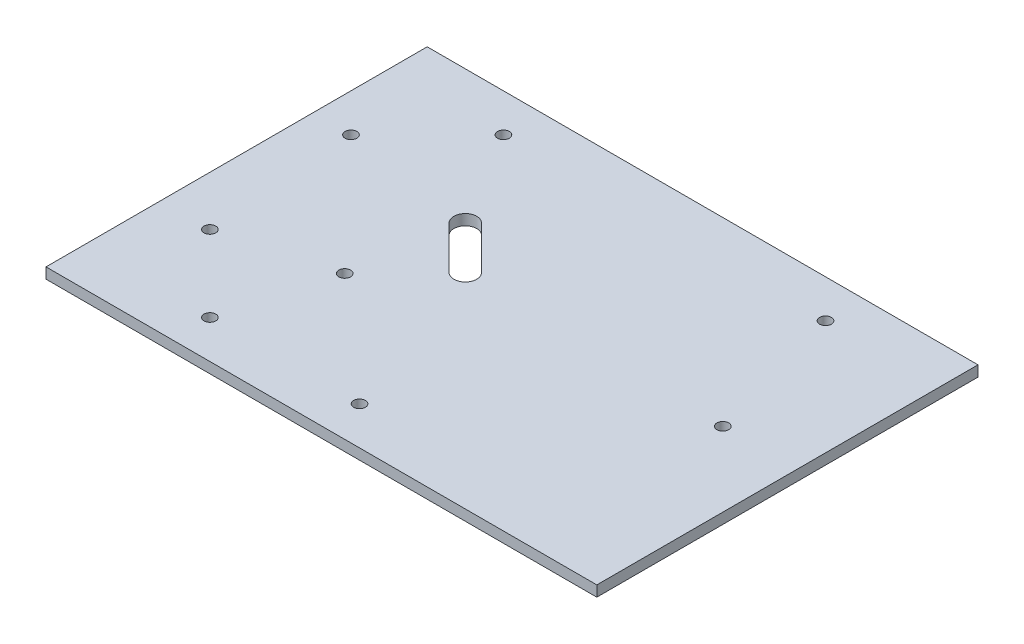
ISO-10303-21;
HEADER;
FILE_DESCRIPTION(('STEP AP214'),'2;1');
FILE_NAME('part.step','',(''),(''),'','','');
FILE_SCHEMA(('AUTOMOTIVE_DESIGN { 1 0 10303 214 1 1 1 1 }'));
ENDSEC;
DATA;
#1=APPLICATION_CONTEXT('core data for automotive mechanical design processes');
#2=APPLICATION_PROTOCOL_DEFINITION('international standard','automotive_design',2000,#1);
#3=PRODUCT_CONTEXT('',#1,'mechanical');
#4=PRODUCT('Part','Part','',(#3));
#5=PRODUCT_RELATED_PRODUCT_CATEGORY('part','',(#4));
#6=PRODUCT_DEFINITION_FORMATION('','',#4);
#7=PRODUCT_DEFINITION_CONTEXT('part definition',#1,'design');
#8=PRODUCT_DEFINITION('design','',#6,#7);
#9=PRODUCT_DEFINITION_SHAPE('','',#8);
#10=(LENGTH_UNIT() NAMED_UNIT(*) SI_UNIT(.MILLI.,.METRE.));
#11=(NAMED_UNIT(*) PLANE_ANGLE_UNIT() SI_UNIT($,.RADIAN.));
#12=(NAMED_UNIT(*) SI_UNIT($,.STERADIAN.) SOLID_ANGLE_UNIT());
#13=UNCERTAINTY_MEASURE_WITH_UNIT(LENGTH_MEASURE(1.E-05),#10,'distance_accuracy_value','');
#14=(GEOMETRIC_REPRESENTATION_CONTEXT(3) GLOBAL_UNCERTAINTY_ASSIGNED_CONTEXT((#13)) GLOBAL_UNIT_ASSIGNED_CONTEXT((#10,
#11,#12)) REPRESENTATION_CONTEXT('',''));
#15=CARTESIAN_POINT('',(0.,0.,0.));
#16=DIRECTION('',(0.,0.,1.));
#17=DIRECTION('',(1.,0.,0.));
#18=AXIS2_PLACEMENT_3D('',#15,#16,#17);
#19=CARTESIAN_POINT('',(0.,2.8,0.));
#20=DIRECTION('',(0.,-1.,0.));
#21=DIRECTION('',(0.,0.,-1.));
#22=AXIS2_PLACEMENT_3D('',#19,#20,#21);
#23=PLANE('',#22);
#24=CARTESIAN_POINT('',(52.75,2.8,-2.56000000000001));
#25=DIRECTION('',(0.,1.,0.));
#26=DIRECTION('',(0.,0.,1.));
#27=AXIS2_PLACEMENT_3D('',#24,#25,#26);
#28=CIRCLE('',#27,1.55);
#29=CARTESIAN_POINT('',(52.75,2.8,-1.01000000000001));
#30=VERTEX_POINT('',#29);
#31=EDGE_CURVE('E275',#30,#30,#28,.T.);
#32=ORIENTED_EDGE('',*,*,#31,.F.);
#33=EDGE_LOOP('',(#32));
#34=FACE_BOUND('',#33,.T.);
#35=CARTESIAN_POINT('',(-62.25,2.8,-20.));
#36=DIRECTION('',(0.,1.,0.));
#37=DIRECTION('',(0.,0.,1.));
#38=AXIS2_PLACEMENT_3D('',#35,#36,#37);
#39=CIRCLE('',#38,1.54999999999999);
#40=CARTESIAN_POINT('',(-62.25,2.8,-18.45));
#41=VERTEX_POINT('',#40);
#42=EDGE_CURVE('E283',#41,#41,#39,.T.);
#43=ORIENTED_EDGE('',*,*,#42,.F.);
#44=EDGE_LOOP('',(#43));
#45=FACE_BOUND('',#44,.T.);
#46=CARTESIAN_POINT('',(-42.25,2.8,-40.));
#47=DIRECTION('',(0.,1.,0.));
#48=DIRECTION('',(0.,0.,1.));
#49=AXIS2_PLACEMENT_3D('',#46,#47,#48);
#50=CIRCLE('',#49,1.55);
#51=CARTESIAN_POINT('',(-42.25,2.8,-38.45));
#52=VERTEX_POINT('',#51);
#53=EDGE_CURVE('E289',#52,#52,#50,.T.);
#54=ORIENTED_EDGE('',*,*,#53,.F.);
#55=EDGE_LOOP('',(#54));
#56=FACE_BOUND('',#55,.T.);
#57=CARTESIAN_POINT('',(42.25,2.8,-40.));
#58=DIRECTION('',(0.,1.,0.));
#59=DIRECTION('',(0.,0.,1.));
#60=AXIS2_PLACEMENT_3D('',#57,#58,#59);
#61=CIRCLE('',#60,1.55);
#62=CARTESIAN_POINT('',(42.25,2.8,-38.45));
#63=VERTEX_POINT('',#62);
#64=EDGE_CURVE('E295',#63,#63,#61,.T.);
#65=ORIENTED_EDGE('',*,*,#64,.F.);
#66=EDGE_LOOP('',(#65));
#67=FACE_BOUND('',#66,.T.);
#68=CARTESIAN_POINT('',(0.,2.8,40.));
#69=DIRECTION('',(0.,1.,0.));
#70=DIRECTION('',(0.,0.,1.));
#71=AXIS2_PLACEMENT_3D('',#68,#69,#70);
#72=CIRCLE('',#71,1.55);
#73=CARTESIAN_POINT('',(0.,2.8,41.55));
#74=VERTEX_POINT('',#73);
#75=EDGE_CURVE('E279',#74,#74,#72,.T.);
#76=ORIENTED_EDGE('',*,*,#75,.F.);
#77=EDGE_LOOP('',(#76));
#78=FACE_BOUND('',#77,.T.);
#79=DIRECTION('',(0.707106781186551,0.,0.707106781186544));
#80=VECTOR('',#79,1.);
#81=CARTESIAN_POINT('',(-29.3713203435596,2.8,-12.8786796564403));
#82=LINE('',#81,#80);
#83=CARTESIAN_POINT('',(-29.3713203435596,2.8,-12.8786796564403));
#84=VERTEX_POINT('',#83);
#85=CARTESIAN_POINT('',(-18.0576118445746,2.8,-1.56497115745581));
#86=VERTEX_POINT('',#85);
#87=EDGE_CURVE('E116',#84,#86,#82,.T.);
#88=ORIENTED_EDGE('',*,*,#87,.F.);
#89=CARTESIAN_POINT('',(-27.25,2.8,-15.));
#90=DIRECTION('',(0.,1.,0.));
#91=DIRECTION('',(0.,0.,1.));
#92=AXIS2_PLACEMENT_3D('',#89,#90,#91);
#93=CIRCLE('',#92,3.);
#94=CARTESIAN_POINT('',(-25.1286796564404,2.8,-17.1213203435596));
#95=VERTEX_POINT('',#94);
#96=EDGE_CURVE('E47',#95,#84,#93,.T.);
#97=ORIENTED_EDGE('',*,*,#96,.F.);
#98=DIRECTION('',(-0.707106781186551,0.,-0.707106781186544));
#99=VECTOR('',#98,1.);
#100=CARTESIAN_POINT('',(-25.1286796564404,2.8,-17.1213203435596));
#101=LINE('',#100,#99);
#102=CARTESIAN_POINT('',(-13.8149711574555,2.8,-5.80761184457495));
#103=VERTEX_POINT('',#102);
#104=EDGE_CURVE('E109',#103,#95,#101,.T.);
#105=ORIENTED_EDGE('',*,*,#104,.F.);
#106=CARTESIAN_POINT('',(-15.936291501015,2.8,-3.68629150101547));
#107=DIRECTION('',(0.,1.,0.));
#108=DIRECTION('',(0.,0.,1.));
#109=AXIS2_PLACEMENT_3D('',#106,#107,#108);
#110=CIRCLE('',#109,3.);
#111=EDGE_CURVE('E123',#86,#103,#110,.T.);
#112=ORIENTED_EDGE('',*,*,#111,.F.);
#113=EDGE_LOOP('',(#88,#97,#105,#112));
#114=FACE_BOUND('',#113,.T.);
#115=DIRECTION('',(0.,0.,-1.));
#116=VECTOR('',#115,1.);
#117=CARTESIAN_POINT('',(72.25,2.8,50.));
#118=LINE('',#117,#116);
#119=CARTESIAN_POINT('',(72.25,2.8,50.));
#120=VERTEX_POINT('',#119);
#121=CARTESIAN_POINT('',(72.25,2.8,-50.));
#122=VERTEX_POINT('',#121);
#123=EDGE_CURVE('E150',#120,#122,#118,.T.);
#124=ORIENTED_EDGE('',*,*,#123,.T.);
#125=DIRECTION('',(-1.,0.,0.));
#126=VECTOR('',#125,1.);
#127=CARTESIAN_POINT('',(-72.25,2.8,-50.));
#128=LINE('',#127,#126);
#129=CARTESIAN_POINT('',(-72.25,2.8,-50.));
#130=VERTEX_POINT('',#129);
#131=EDGE_CURVE('E153',#122,#130,#128,.T.);
#132=ORIENTED_EDGE('',*,*,#131,.T.);
#133=DIRECTION('',(0.,0.,1.));
#134=VECTOR('',#133,1.);
#135=CARTESIAN_POINT('',(-72.25,2.8,50.));
#136=LINE('',#135,#134);
#137=CARTESIAN_POINT('',(-72.25,2.8,50.));
#138=VERTEX_POINT('',#137);
#139=EDGE_CURVE('E156',#130,#138,#136,.T.);
#140=ORIENTED_EDGE('',*,*,#139,.T.);
#141=DIRECTION('',(1.,0.,0.));
#142=VECTOR('',#141,1.);
#143=CARTESIAN_POINT('',(-72.25,2.8,50.));
#144=LINE('',#143,#142);
#145=EDGE_CURVE('E158',#138,#120,#144,.T.);
#146=ORIENTED_EDGE('',*,*,#145,.T.);
#147=EDGE_LOOP('',(#124,#132,#140,#146));
#148=FACE_BOUND('',#147,.T.);
#149=CARTESIAN_POINT('',(-59.25,2.8,20.));
#150=DIRECTION('',(0.,1.,0.));
#151=DIRECTION('',(0.,0.,1.));
#152=AXIS2_PLACEMENT_3D('',#149,#150,#151);
#153=CIRCLE('',#152,1.55);
#154=CARTESIAN_POINT('',(-59.25,2.8,21.55));
#155=VERTEX_POINT('',#154);
#156=EDGE_CURVE('E144',#155,#155,#153,.T.);
#157=ORIENTED_EDGE('',*,*,#156,.F.);
#158=EDGE_LOOP('',(#157));
#159=FACE_BOUND('',#158,.T.);
#160=CARTESIAN_POINT('',(-39.25,2.8,40.));
#161=DIRECTION('',(0.,1.,0.));
#162=DIRECTION('',(0.,0.,1.));
#163=AXIS2_PLACEMENT_3D('',#160,#161,#162);
#164=CIRCLE('',#163,1.55);
#165=CARTESIAN_POINT('',(-39.25,2.8,41.55));
#166=VERTEX_POINT('',#165);
#167=EDGE_CURVE('E138',#166,#166,#164,.T.);
#168=ORIENTED_EDGE('',*,*,#167,.F.);
#169=EDGE_LOOP('',(#168));
#170=FACE_BOUND('',#169,.T.);
#171=CARTESIAN_POINT('',(-31.5723304703363,2.8,12.3223304703363));
#172=DIRECTION('',(0.,1.,0.));
#173=DIRECTION('',(0.,0.,1.));
#174=AXIS2_PLACEMENT_3D('',#171,#172,#173);
#175=CIRCLE('',#174,1.55);
#176=CARTESIAN_POINT('',(-31.5723304703363,2.8,13.8723304703363));
#177=VERTEX_POINT('',#176);
#178=EDGE_CURVE('E132',#177,#177,#175,.T.);
#179=ORIENTED_EDGE('',*,*,#178,.F.);
#180=EDGE_LOOP('',(#179));
#181=FACE_BOUND('',#180,.T.);
#182=ADVANCED_FACE('F32',(#34,#45,#56,#67,#78,#114,#148,#159,#170,#181),#23,.F.);
#183=CARTESIAN_POINT('',(0.,0.,0.));
#184=DIRECTION('',(0.,-1.,0.));
#185=DIRECTION('',(0.,0.,-1.));
#186=AXIS2_PLACEMENT_3D('',#183,#184,#185);
#187=PLANE('',#186);
#188=CARTESIAN_POINT('',(52.75,0.,-2.56000000000001));
#189=DIRECTION('',(0.,-1.,0.));
#190=DIRECTION('',(0.,0.,-1.));
#191=AXIS2_PLACEMENT_3D('',#188,#189,#190);
#192=CIRCLE('',#191,1.55);
#193=CARTESIAN_POINT('',(52.75,0.,-4.11000000000001));
#194=VERTEX_POINT('',#193);
#195=EDGE_CURVE('E273',#194,#194,#192,.F.);
#196=ORIENTED_EDGE('',*,*,#195,.T.);
#197=EDGE_LOOP('',(#196));
#198=FACE_BOUND('',#197,.T.);
#199=CARTESIAN_POINT('',(-62.25,0.,-20.));
#200=DIRECTION('',(0.,-1.,0.));
#201=DIRECTION('',(0.,0.,-1.));
#202=AXIS2_PLACEMENT_3D('',#199,#200,#201);
#203=CIRCLE('',#202,1.54999999999999);
#204=CARTESIAN_POINT('',(-62.25,0.,-21.55));
#205=VERTEX_POINT('',#204);
#206=EDGE_CURVE('E286',#205,#205,#203,.F.);
#207=ORIENTED_EDGE('',*,*,#206,.T.);
#208=EDGE_LOOP('',(#207));
#209=FACE_BOUND('',#208,.T.);
#210=CARTESIAN_POINT('',(-42.25,0.,-40.));
#211=DIRECTION('',(0.,-1.,0.));
#212=DIRECTION('',(0.,0.,-1.));
#213=AXIS2_PLACEMENT_3D('',#210,#211,#212);
#214=CIRCLE('',#213,1.55);
#215=CARTESIAN_POINT('',(-42.25,0.,-41.55));
#216=VERTEX_POINT('',#215);
#217=EDGE_CURVE('E292',#216,#216,#214,.F.);
#218=ORIENTED_EDGE('',*,*,#217,.T.);
#219=EDGE_LOOP('',(#218));
#220=FACE_BOUND('',#219,.T.);
#221=CARTESIAN_POINT('',(42.25,0.,-40.));
#222=DIRECTION('',(0.,-1.,0.));
#223=DIRECTION('',(0.,0.,-1.));
#224=AXIS2_PLACEMENT_3D('',#221,#222,#223);
#225=CIRCLE('',#224,1.55);
#226=CARTESIAN_POINT('',(42.25,0.,-41.55));
#227=VERTEX_POINT('',#226);
#228=EDGE_CURVE('E298',#227,#227,#225,.F.);
#229=ORIENTED_EDGE('',*,*,#228,.T.);
#230=EDGE_LOOP('',(#229));
#231=FACE_BOUND('',#230,.T.);
#232=CARTESIAN_POINT('',(0.,0.,40.));
#233=DIRECTION('',(0.,-1.,0.));
#234=DIRECTION('',(0.,0.,-1.));
#235=AXIS2_PLACEMENT_3D('',#232,#233,#234);
#236=CIRCLE('',#235,1.55);
#237=CARTESIAN_POINT('',(0.,0.,38.45));
#238=VERTEX_POINT('',#237);
#239=EDGE_CURVE('E276',#238,#238,#236,.F.);
#240=ORIENTED_EDGE('',*,*,#239,.T.);
#241=EDGE_LOOP('',(#240));
#242=FACE_BOUND('',#241,.T.);
#243=CARTESIAN_POINT('',(-27.25,0.,-15.));
#244=DIRECTION('',(0.,-1.,0.));
#245=DIRECTION('',(0.,0.,-1.));
#246=AXIS2_PLACEMENT_3D('',#243,#244,#245);
#247=CIRCLE('',#246,3.);
#248=CARTESIAN_POINT('',(-25.1286796564404,0.,-17.1213203435596));
#249=VERTEX_POINT('',#248);
#250=CARTESIAN_POINT('',(-29.3713203435596,0.,-12.8786796564403));
#251=VERTEX_POINT('',#250);
#252=EDGE_CURVE('E107',#249,#251,#247,.F.);
#253=ORIENTED_EDGE('',*,*,#252,.T.);
#254=DIRECTION('',(0.707106781186551,0.,0.707106781186544));
#255=VECTOR('',#254,1.);
#256=CARTESIAN_POINT('',(-29.3713203435596,0.,-12.8786796564403));
#257=LINE('',#256,#255);
#258=CARTESIAN_POINT('',(-18.057611844575,0.,-1.56497115745581));
#259=VERTEX_POINT('',#258);
#260=EDGE_CURVE('E96',#251,#259,#257,.T.);
#261=ORIENTED_EDGE('',*,*,#260,.T.);
#262=CARTESIAN_POINT('',(-15.936291501015,0.,-3.68629150101547));
#263=DIRECTION('',(0.,-1.,0.));
#264=DIRECTION('',(0.,0.,-1.));
#265=AXIS2_PLACEMENT_3D('',#262,#263,#264);
#266=CIRCLE('',#265,3.);
#267=CARTESIAN_POINT('',(-13.8149711574554,0.,-5.80761184457512));
#268=VERTEX_POINT('',#267);
#269=EDGE_CURVE('E118',#259,#268,#266,.F.);
#270=ORIENTED_EDGE('',*,*,#269,.T.);
#271=DIRECTION('',(-0.707106781186551,0.,-0.707106781186544));
#272=VECTOR('',#271,1.);
#273=CARTESIAN_POINT('',(-25.1286796564404,0.,-17.1213203435596));
#274=LINE('',#273,#272);
#275=EDGE_CURVE('E114',#268,#249,#274,.T.);
#276=ORIENTED_EDGE('',*,*,#275,.T.);
#277=EDGE_LOOP('',(#253,#261,#270,#276));
#278=FACE_BOUND('',#277,.T.);
#279=CARTESIAN_POINT('',(-39.25,0.,40.));
#280=DIRECTION('',(0.,1.,0.));
#281=DIRECTION('',(0.,0.,1.));
#282=AXIS2_PLACEMENT_3D('',#279,#280,#281);
#283=CIRCLE('',#282,1.55);
#284=CARTESIAN_POINT('',(-39.25,0.,41.55));
#285=VERTEX_POINT('',#284);
#286=EDGE_CURVE('E135',#285,#285,#283,.T.);
#287=ORIENTED_EDGE('',*,*,#286,.T.);
#288=EDGE_LOOP('',(#287));
#289=FACE_BOUND('',#288,.T.);
#290=DIRECTION('',(0.,0.,-1.));
#291=VECTOR('',#290,1.);
#292=CARTESIAN_POINT('',(72.25,0.,50.));
#293=LINE('',#292,#291);
#294=CARTESIAN_POINT('',(72.25,0.,50.));
#295=VERTEX_POINT('',#294);
#296=CARTESIAN_POINT('',(72.25,0.,-50.));
#297=VERTEX_POINT('',#296);
#298=EDGE_CURVE('E147',#295,#297,#293,.T.);
#299=ORIENTED_EDGE('',*,*,#298,.F.);
#300=DIRECTION('',(1.,0.,0.));
#301=VECTOR('',#300,1.);
#302=CARTESIAN_POINT('',(-72.25,0.,50.));
#303=LINE('',#302,#301);
#304=CARTESIAN_POINT('',(-72.25,0.,50.));
#305=VERTEX_POINT('',#304);
#306=EDGE_CURVE('E154',#305,#295,#303,.T.);
#307=ORIENTED_EDGE('',*,*,#306,.F.);
#308=DIRECTION('',(0.,0.,1.));
#309=VECTOR('',#308,1.);
#310=CARTESIAN_POINT('',(-72.25,0.,50.));
#311=LINE('',#310,#309);
#312=CARTESIAN_POINT('',(-72.25,0.,-50.));
#313=VERTEX_POINT('',#312);
#314=EDGE_CURVE('E165',#313,#305,#311,.T.);
#315=ORIENTED_EDGE('',*,*,#314,.F.);
#316=DIRECTION('',(-1.,0.,0.));
#317=VECTOR('',#316,1.);
#318=CARTESIAN_POINT('',(-72.25,0.,-50.));
#319=LINE('',#318,#317);
#320=EDGE_CURVE('E163',#297,#313,#319,.T.);
#321=ORIENTED_EDGE('',*,*,#320,.F.);
#322=EDGE_LOOP('',(#299,#307,#315,#321));
#323=FACE_BOUND('',#322,.T.);
#324=CARTESIAN_POINT('',(-59.25,0.,20.));
#325=DIRECTION('',(0.,1.,0.));
#326=DIRECTION('',(0.,0.,1.));
#327=AXIS2_PLACEMENT_3D('',#324,#325,#326);
#328=CIRCLE('',#327,1.55);
#329=CARTESIAN_POINT('',(-59.25,0.,21.55));
#330=VERTEX_POINT('',#329);
#331=EDGE_CURVE('E141',#330,#330,#328,.T.);
#332=ORIENTED_EDGE('',*,*,#331,.T.);
#333=EDGE_LOOP('',(#332));
#334=FACE_BOUND('',#333,.T.);
#335=CARTESIAN_POINT('',(-31.5723304703363,0.,12.3223304703363));
#336=DIRECTION('',(0.,1.,0.));
#337=DIRECTION('',(0.,0.,1.));
#338=AXIS2_PLACEMENT_3D('',#335,#336,#337);
#339=CIRCLE('',#338,1.55);
#340=CARTESIAN_POINT('',(-31.5723304703363,0.,13.8723304703363));
#341=VERTEX_POINT('',#340);
#342=EDGE_CURVE('E103',#341,#341,#339,.T.);
#343=ORIENTED_EDGE('',*,*,#342,.T.);
#344=EDGE_LOOP('',(#343));
#345=FACE_BOUND('',#344,.T.);
#346=ADVANCED_FACE('F112',(#198,#209,#220,#231,#242,#278,#289,#323,#334,#345),#187,.T.);
#347=CARTESIAN_POINT('',(72.25,2.8,50.));
#348=DIRECTION('',(-1.,0.,0.));
#349=DIRECTION('',(0.,0.,1.));
#350=AXIS2_PLACEMENT_3D('',#347,#348,#349);
#351=PLANE('',#350);
#352=ORIENTED_EDGE('',*,*,#298,.T.);
#353=DIRECTION('',(0.,-1.,0.));
#354=VECTOR('',#353,1.);
#355=CARTESIAN_POINT('',(72.25,2.8,-50.));
#356=LINE('',#355,#354);
#357=EDGE_CURVE('E11',#122,#297,#356,.T.);
#358=ORIENTED_EDGE('',*,*,#357,.F.);
#359=ORIENTED_EDGE('',*,*,#123,.F.);
#360=DIRECTION('',(0.,-1.,0.));
#361=VECTOR('',#360,1.);
#362=CARTESIAN_POINT('',(72.25,2.8,50.));
#363=LINE('',#362,#361);
#364=EDGE_CURVE('E160',#120,#295,#363,.T.);
#365=ORIENTED_EDGE('',*,*,#364,.T.);
#366=EDGE_LOOP('',(#352,#358,#359,#365));
#367=FACE_BOUND('',#366,.T.);
#368=ADVANCED_FACE('F34',(#367),#351,.F.);
#369=CARTESIAN_POINT('',(-72.25,2.8,-50.));
#370=DIRECTION('',(0.,0.,1.));
#371=DIRECTION('',(1.,0.,0.));
#372=AXIS2_PLACEMENT_3D('',#369,#370,#371);
#373=PLANE('',#372);
#374=ORIENTED_EDGE('',*,*,#320,.T.);
#375=DIRECTION('',(0.,-1.,0.));
#376=VECTOR('',#375,1.);
#377=CARTESIAN_POINT('',(-72.25,2.8,-50.));
#378=LINE('',#377,#376);
#379=EDGE_CURVE('E40',#130,#313,#378,.T.);
#380=ORIENTED_EDGE('',*,*,#379,.F.);
#381=ORIENTED_EDGE('',*,*,#131,.F.);
#382=ORIENTED_EDGE('',*,*,#357,.T.);
#383=EDGE_LOOP('',(#374,#380,#381,#382));
#384=FACE_BOUND('',#383,.T.);
#385=ADVANCED_FACE('F193',(#384),#373,.F.);
#386=CARTESIAN_POINT('',(-72.25,2.8,50.));
#387=DIRECTION('',(1.,0.,0.));
#388=DIRECTION('',(0.,0.,-1.));
#389=AXIS2_PLACEMENT_3D('',#386,#387,#388);
#390=PLANE('',#389);
#391=ORIENTED_EDGE('',*,*,#314,.T.);
#392=DIRECTION('',(0.,-1.,0.));
#393=VECTOR('',#392,1.);
#394=CARTESIAN_POINT('',(-72.25,2.8,50.));
#395=LINE('',#394,#393);
#396=EDGE_CURVE('E170',#138,#305,#395,.T.);
#397=ORIENTED_EDGE('',*,*,#396,.F.);
#398=ORIENTED_EDGE('',*,*,#139,.F.);
#399=ORIENTED_EDGE('',*,*,#379,.T.);
#400=EDGE_LOOP('',(#391,#397,#398,#399));
#401=FACE_BOUND('',#400,.T.);
#402=ADVANCED_FACE('F177',(#401),#390,.F.);
#403=CARTESIAN_POINT('',(-72.25,2.8,50.));
#404=DIRECTION('',(0.,0.,-1.));
#405=DIRECTION('',(-1.,0.,0.));
#406=AXIS2_PLACEMENT_3D('',#403,#404,#405);
#407=PLANE('',#406);
#408=ORIENTED_EDGE('',*,*,#306,.T.);
#409=ORIENTED_EDGE('',*,*,#364,.F.);
#410=ORIENTED_EDGE('',*,*,#145,.F.);
#411=ORIENTED_EDGE('',*,*,#396,.T.);
#412=EDGE_LOOP('',(#408,#409,#410,#411));
#413=FACE_BOUND('',#412,.T.);
#414=ADVANCED_FACE('F186',(#413),#407,.F.);
#415=CARTESIAN_POINT('',(-59.25,2.8,20.));
#416=DIRECTION('',(0.,-1.,0.));
#417=DIRECTION('',(0.,0.,-1.));
#418=AXIS2_PLACEMENT_3D('',#415,#416,#417);
#419=CYLINDRICAL_SURFACE('',#418,1.55);
#420=ORIENTED_EDGE('',*,*,#156,.T.);
#421=EDGE_LOOP('',(#420));
#422=FACE_BOUND('',#421,.T.);
#423=ORIENTED_EDGE('',*,*,#331,.F.);
#424=EDGE_LOOP('',(#423));
#425=FACE_BOUND('',#424,.T.);
#426=ADVANCED_FACE('F211',(#422,#425),#419,.F.);
#427=CARTESIAN_POINT('',(-39.25,2.8,40.));
#428=DIRECTION('',(0.,-1.,0.));
#429=DIRECTION('',(0.,0.,-1.));
#430=AXIS2_PLACEMENT_3D('',#427,#428,#429);
#431=CYLINDRICAL_SURFACE('',#430,1.55);
#432=ORIENTED_EDGE('',*,*,#167,.T.);
#433=EDGE_LOOP('',(#432));
#434=FACE_BOUND('',#433,.T.);
#435=ORIENTED_EDGE('',*,*,#286,.F.);
#436=EDGE_LOOP('',(#435));
#437=FACE_BOUND('',#436,.T.);
#438=ADVANCED_FACE('F218',(#434,#437),#431,.F.);
#439=CARTESIAN_POINT('',(-31.5723304703363,2.8,12.3223304703363));
#440=DIRECTION('',(0.,-1.,0.));
#441=DIRECTION('',(0.,0.,-1.));
#442=AXIS2_PLACEMENT_3D('',#439,#440,#441);
#443=CYLINDRICAL_SURFACE('',#442,1.55);
#444=ORIENTED_EDGE('',*,*,#178,.T.);
#445=EDGE_LOOP('',(#444));
#446=FACE_BOUND('',#445,.T.);
#447=ORIENTED_EDGE('',*,*,#342,.F.);
#448=EDGE_LOOP('',(#447));
#449=FACE_BOUND('',#448,.T.);
#450=ADVANCED_FACE('F223',(#446,#449),#443,.F.);
#451=CARTESIAN_POINT('',(-27.25,-0.00100000000000013,-15.));
#452=DIRECTION('',(0.,1.,0.));
#453=DIRECTION('',(0.,0.,1.));
#454=AXIS2_PLACEMENT_3D('',#451,#452,#453);
#455=CYLINDRICAL_SURFACE('',#454,3.);
#456=DIRECTION('',(0.,1.,0.));
#457=VECTOR('',#456,1.);
#458=CARTESIAN_POINT('',(-25.1286796564404,-0.00100000000000013,-17.1213203435596));
#459=LINE('',#458,#457);
#460=EDGE_CURVE('E104',#249,#95,#459,.T.);
#461=ORIENTED_EDGE('',*,*,#460,.T.);
#462=ORIENTED_EDGE('',*,*,#96,.T.);
#463=DIRECTION('',(0.,1.,0.));
#464=VECTOR('',#463,1.);
#465=CARTESIAN_POINT('',(-29.3713203435596,-0.00100000000000013,-12.8786796564403));
#466=LINE('',#465,#464);
#467=EDGE_CURVE('E98',#251,#84,#466,.T.);
#468=ORIENTED_EDGE('',*,*,#467,.F.);
#469=ORIENTED_EDGE('',*,*,#252,.F.);
#470=EDGE_LOOP('',(#461,#462,#468,#469));
#471=FACE_BOUND('',#470,.T.);
#472=ADVANCED_FACE('F106',(#471),#455,.F.);
#473=CARTESIAN_POINT('',(-25.1286796564404,-0.00100000000000013,-17.1213203435596));
#474=DIRECTION('',(0.707106781186544,0.,-0.707106781186551));
#475=DIRECTION('',(-0.707106781186551,0.,-0.707106781186544));
#476=AXIS2_PLACEMENT_3D('',#473,#474,#475);
#477=PLANE('',#476);
#478=DIRECTION('',(0.,1.,0.));
#479=VECTOR('',#478,1.);
#480=CARTESIAN_POINT('',(-13.8149711574555,-0.00100000000000013,-5.80761184457495));
#481=LINE('',#480,#479);
#482=EDGE_CURVE('E129',#268,#103,#481,.T.);
#483=ORIENTED_EDGE('',*,*,#482,.T.);
#484=ORIENTED_EDGE('',*,*,#104,.T.);
#485=ORIENTED_EDGE('',*,*,#460,.F.);
#486=ORIENTED_EDGE('',*,*,#275,.F.);
#487=EDGE_LOOP('',(#483,#484,#485,#486));
#488=FACE_BOUND('',#487,.T.);
#489=ADVANCED_FACE('F237',(#488),#477,.F.);
#490=CARTESIAN_POINT('',(-15.936291501015,-0.00100000000000013,-3.68629150101547));
#491=DIRECTION('',(0.,1.,0.));
#492=DIRECTION('',(0.,0.,1.));
#493=AXIS2_PLACEMENT_3D('',#490,#491,#492);
#494=CYLINDRICAL_SURFACE('',#493,3.);
#495=DIRECTION('',(0.,1.,0.));
#496=VECTOR('',#495,1.);
#497=CARTESIAN_POINT('',(-18.0576118445746,-0.00100000000000013,-1.56497115745581));
#498=LINE('',#497,#496);
#499=EDGE_CURVE('E55',#259,#86,#498,.T.);
#500=ORIENTED_EDGE('',*,*,#499,.T.);
#501=ORIENTED_EDGE('',*,*,#111,.T.);
#502=ORIENTED_EDGE('',*,*,#482,.F.);
#503=ORIENTED_EDGE('',*,*,#269,.F.);
#504=EDGE_LOOP('',(#500,#501,#502,#503));
#505=FACE_BOUND('',#504,.T.);
#506=ADVANCED_FACE('F243',(#505),#494,.F.);
#507=CARTESIAN_POINT('',(-29.3713203435596,-0.00100000000000013,-12.8786796564403));
#508=DIRECTION('',(-0.707106781186544,0.,0.707106781186551));
#509=DIRECTION('',(0.707106781186551,0.,0.707106781186544));
#510=AXIS2_PLACEMENT_3D('',#507,#508,#509);
#511=PLANE('',#510);
#512=ORIENTED_EDGE('',*,*,#467,.T.);
#513=ORIENTED_EDGE('',*,*,#87,.T.);
#514=ORIENTED_EDGE('',*,*,#499,.F.);
#515=ORIENTED_EDGE('',*,*,#260,.F.);
#516=EDGE_LOOP('',(#512,#513,#514,#515));
#517=FACE_BOUND('',#516,.T.);
#518=ADVANCED_FACE('F97',(#517),#511,.F.);
#519=CARTESIAN_POINT('',(0.,-0.00100000000000013,40.));
#520=DIRECTION('',(0.,1.,0.));
#521=DIRECTION('',(0.,0.,1.));
#522=AXIS2_PLACEMENT_3D('',#519,#520,#521);
#523=CYLINDRICAL_SURFACE('',#522,1.55);
#524=ORIENTED_EDGE('',*,*,#239,.F.);
#525=EDGE_LOOP('',(#524));
#526=FACE_BOUND('',#525,.T.);
#527=ORIENTED_EDGE('',*,*,#75,.T.);
#528=EDGE_LOOP('',(#527));
#529=FACE_BOUND('',#528,.T.);
#530=ADVANCED_FACE('F242',(#526,#529),#523,.F.);
#531=CARTESIAN_POINT('',(42.25,-0.00100000000000013,-40.));
#532=DIRECTION('',(0.,1.,0.));
#533=DIRECTION('',(0.,0.,1.));
#534=AXIS2_PLACEMENT_3D('',#531,#532,#533);
#535=CYLINDRICAL_SURFACE('',#534,1.55);
#536=ORIENTED_EDGE('',*,*,#228,.F.);
#537=EDGE_LOOP('',(#536));
#538=FACE_BOUND('',#537,.T.);
#539=ORIENTED_EDGE('',*,*,#64,.T.);
#540=EDGE_LOOP('',(#539));
#541=FACE_BOUND('',#540,.T.);
#542=ADVANCED_FACE('F252',(#538,#541),#535,.F.);
#543=CARTESIAN_POINT('',(-42.25,-0.00100000000000013,-40.));
#544=DIRECTION('',(0.,1.,0.));
#545=DIRECTION('',(0.,0.,1.));
#546=AXIS2_PLACEMENT_3D('',#543,#544,#545);
#547=CYLINDRICAL_SURFACE('',#546,1.55);
#548=ORIENTED_EDGE('',*,*,#217,.F.);
#549=EDGE_LOOP('',(#548));
#550=FACE_BOUND('',#549,.T.);
#551=ORIENTED_EDGE('',*,*,#53,.T.);
#552=EDGE_LOOP('',(#551));
#553=FACE_BOUND('',#552,.T.);
#554=ADVANCED_FACE('F256',(#550,#553),#547,.F.);
#555=CARTESIAN_POINT('',(-62.25,-0.00100000000000013,-20.));
#556=DIRECTION('',(0.,1.,0.));
#557=DIRECTION('',(0.,0.,1.));
#558=AXIS2_PLACEMENT_3D('',#555,#556,#557);
#559=CYLINDRICAL_SURFACE('',#558,1.54999999999999);
#560=ORIENTED_EDGE('',*,*,#206,.F.);
#561=EDGE_LOOP('',(#560));
#562=FACE_BOUND('',#561,.T.);
#563=ORIENTED_EDGE('',*,*,#42,.T.);
#564=EDGE_LOOP('',(#563));
#565=FACE_BOUND('',#564,.T.);
#566=ADVANCED_FACE('F260',(#562,#565),#559,.F.);
#567=CARTESIAN_POINT('',(52.75,-0.00100000000000013,-2.56000000000001));
#568=DIRECTION('',(0.,1.,0.));
#569=DIRECTION('',(0.,0.,1.));
#570=AXIS2_PLACEMENT_3D('',#567,#568,#569);
#571=CYLINDRICAL_SURFACE('',#570,1.55);
#572=ORIENTED_EDGE('',*,*,#195,.F.);
#573=EDGE_LOOP('',(#572));
#574=FACE_BOUND('',#573,.T.);
#575=ORIENTED_EDGE('',*,*,#31,.T.);
#576=EDGE_LOOP('',(#575));
#577=FACE_BOUND('',#576,.T.);
#578=ADVANCED_FACE('F264',(#574,#577),#571,.F.);
#579=CLOSED_SHELL('',(#182,#346,#368,#385,#402,#414,#426,#438,#450,#472,#489,#506,#518,#530,
#542,#554,#566,#578));
#580=MANIFOLD_SOLID_BREP('B2',#579);
#581=ADVANCED_BREP_SHAPE_REPRESENTATION('',(#18,#580),#14);
#582=SHAPE_DEFINITION_REPRESENTATION(#9,#581);
ENDSEC;
END-ISO-10303-21;
